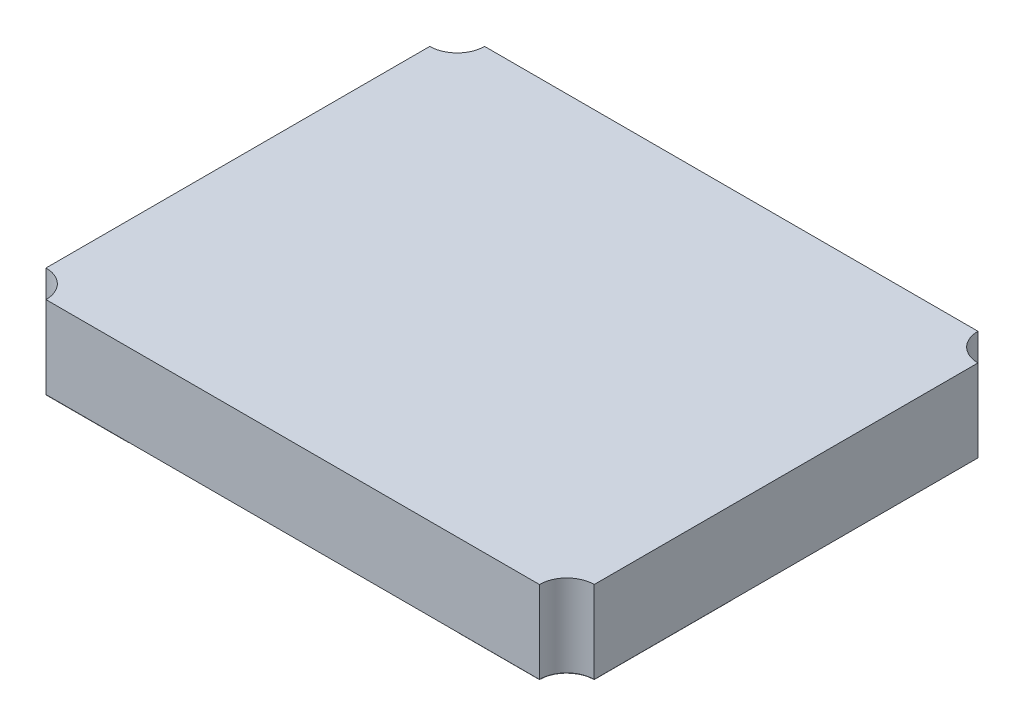
ISO-10303-21;
HEADER;
FILE_DESCRIPTION(('STEP AP214'),'2;1');
FILE_NAME('part.step','',(''),(''),'','','');
FILE_SCHEMA(('AUTOMOTIVE_DESIGN { 1 0 10303 214 1 1 1 1 }'));
ENDSEC;
DATA;
#1=APPLICATION_CONTEXT('core data for automotive mechanical design processes');
#2=APPLICATION_PROTOCOL_DEFINITION('international standard','automotive_design',2000,#1);
#3=PRODUCT_CONTEXT('',#1,'mechanical');
#4=PRODUCT('Part','Part','',(#3));
#5=PRODUCT_RELATED_PRODUCT_CATEGORY('part','',(#4));
#6=PRODUCT_DEFINITION_FORMATION('','',#4);
#7=PRODUCT_DEFINITION_CONTEXT('part definition',#1,'design');
#8=PRODUCT_DEFINITION('design','',#6,#7);
#9=PRODUCT_DEFINITION_SHAPE('','',#8);
#10=(LENGTH_UNIT() NAMED_UNIT(*) SI_UNIT(.MILLI.,.METRE.));
#11=(NAMED_UNIT(*) PLANE_ANGLE_UNIT() SI_UNIT($,.RADIAN.));
#12=(NAMED_UNIT(*) SI_UNIT($,.STERADIAN.) SOLID_ANGLE_UNIT());
#13=UNCERTAINTY_MEASURE_WITH_UNIT(LENGTH_MEASURE(1.E-05),#10,'distance_accuracy_value','');
#14=(GEOMETRIC_REPRESENTATION_CONTEXT(3) GLOBAL_UNCERTAINTY_ASSIGNED_CONTEXT((#13)) GLOBAL_UNIT_ASSIGNED_CONTEXT((#10,
#11,#12)) REPRESENTATION_CONTEXT('',''));
#15=CARTESIAN_POINT('',(0.,0.,0.));
#16=DIRECTION('',(0.,0.,1.));
#17=DIRECTION('',(1.,0.,0.));
#18=AXIS2_PLACEMENT_3D('',#15,#16,#17);
#19=CARTESIAN_POINT('',(0.799999993294,-0.001,0.499999997765));
#20=DIRECTION('',(0.,-1.,0.));
#21=DIRECTION('',(0.,0.,-1.));
#22=AXIS2_PLACEMENT_3D('',#19,#20,#21);
#23=PLANE('',#22);
#24=CARTESIAN_POINT('',(0.9,-0.001,0.8));
#25=DIRECTION('',(-1.,0.,0.));
#26=VECTOR('',#25,1.);
#27=LINE('',#24,#26);
#28=CARTESIAN_POINT('',(0.9,-0.0005,0.8));
#29=VERTEX_POINT('',#28);
#30=CARTESIAN_POINT('',(0.599999986589,-0.0005,0.8));
#31=VERTEX_POINT('',#30);
#32=EDGE_CURVE('P0_E46',#29,#31,#27,.T.);
#33=ORIENTED_EDGE('',*,*,#32,.T.);
#34=CARTESIAN_POINT('',(0.599999986589,-0.001,0.8));
#35=DIRECTION('',(0.,0.,-1.));
#36=VECTOR('',#35,1.);
#37=LINE('',#34,#36);
#38=CARTESIAN_POINT('',(0.599999986589,-0.0005,0.19999999553));
#39=VERTEX_POINT('',#38);
#40=EDGE_CURVE('P0_E43',#31,#39,#37,.T.);
#41=ORIENTED_EDGE('',*,*,#40,.T.);
#42=CARTESIAN_POINT('',(0.599999986589,-0.001,0.19999999553));
#43=DIRECTION('',(1.,0.,0.));
#44=VECTOR('',#43,1.);
#45=LINE('',#42,#44);
#46=CARTESIAN_POINT('',(0.999999977648,-0.0005,0.19999999553));
#47=VERTEX_POINT('',#46);
#48=EDGE_CURVE('P0_E104',#39,#47,#45,.T.);
#49=ORIENTED_EDGE('',*,*,#48,.T.);
#50=CARTESIAN_POINT('',(0.999999977648,-0.001,0.19999999553));
#51=DIRECTION('',(0.,0.,1.));
#52=VECTOR('',#51,1.);
#53=LINE('',#50,#52);
#54=CARTESIAN_POINT('',(0.999999982304557,-0.0005,0.7));
#55=VERTEX_POINT('',#54);
#56=EDGE_CURVE('P0_E27',#47,#55,#53,.T.);
#57=ORIENTED_EDGE('',*,*,#56,.T.);
#58=CARTESIAN_POINT('',(0.999999986961113,-0.001,0.7));
#59=CARTESIAN_POINT('',(0.959351857945959,-0.001,0.700000005300111));
#60=CARTESIAN_POINT('',(0.929289317271363,-0.001,0.729289326491328));
#61=CARTESIAN_POINT('',(0.9,-0.001,0.757825311866552));
#62=CARTESIAN_POINT('',(0.9,-0.001,0.8));
#63=B_SPLINE_CURVE_WITH_KNOTS('',2,(#58,#59,#60,#61,#62),.UNSPECIFIED.,.F.,.F.,(3,2,3),(0.,0.5,
1.),.UNSPECIFIED.);
#64=EDGE_CURVE('P0_E11',#55,#29,#63,.T.);
#65=ORIENTED_EDGE('',*,*,#64,.T.);
#66=EDGE_LOOP('',(#33,#41,#49,#57,#65));
#67=FACE_BOUND('',#66,.T.);
#68=ADVANCED_FACE('P0_F16',(#67),#23,.T.);
#69=CARTESIAN_POINT('',(0.799999993294,0.,0.499999997765));
#70=DIRECTION('',(0.,-1.,0.));
#71=DIRECTION('',(0.,0.,-1.));
#72=AXIS2_PLACEMENT_3D('',#69,#70,#71);
#73=PLANE('',#72);
#74=ORIENTED_EDGE('',*,*,#56,.F.);
#75=ORIENTED_EDGE('',*,*,#48,.F.);
#76=ORIENTED_EDGE('',*,*,#40,.F.);
#77=ORIENTED_EDGE('',*,*,#32,.F.);
#78=ORIENTED_EDGE('',*,*,#64,.F.);
#79=EDGE_LOOP('',(#74,#75,#76,#77,#78));
#80=FACE_BOUND('',#79,.T.);
#81=ADVANCED_FACE('P0_F48',(#80),#73,.F.);
#82=CLOSED_SHELL('',(#68,#81));
#83=MANIFOLD_SOLID_BREP('P0_B1',#82);
#84=CARTESIAN_POINT('',(0.,0.,0.));
#85=DIRECTION('',(0.,-1.,0.));
#86=DIRECTION('',(0.,0.,-1.));
#87=AXIS2_PLACEMENT_3D('',#84,#85,#86);
#88=PLANE('',#87);
#89=DIRECTION('',(0.,0.,1.));
#90=VECTOR('',#89,1.);
#91=CARTESIAN_POINT('',(-1.,0.,0.7));
#92=LINE('',#91,#90);
#93=CARTESIAN_POINT('',(-1.,0.,-0.7));
#94=VERTEX_POINT('',#93);
#95=CARTESIAN_POINT('',(-1.,0.,0.7));
#96=VERTEX_POINT('',#95);
#97=EDGE_CURVE('P1_E109',#94,#96,#92,.T.);
#98=ORIENTED_EDGE('',*,*,#97,.F.);
#99=CARTESIAN_POINT('',(-1.,0.,-0.8));
#100=DIRECTION('',(0.,-1.,0.));
#101=DIRECTION('',(0.,0.,-1.));
#102=AXIS2_PLACEMENT_3D('',#99,#100,#101);
#103=CIRCLE('',#102,0.1);
#104=CARTESIAN_POINT('',(-0.9,0.,-0.8));
#105=VERTEX_POINT('',#104);
#106=EDGE_CURVE('P1_E88',#94,#105,#103,.F.);
#107=ORIENTED_EDGE('',*,*,#106,.T.);
#108=DIRECTION('',(-1.,0.,0.));
#109=VECTOR('',#108,1.);
#110=CARTESIAN_POINT('',(-0.9,0.,-0.8));
#111=LINE('',#110,#109);
#112=CARTESIAN_POINT('',(0.9,0.,-0.8));
#113=VERTEX_POINT('',#112);
#114=EDGE_CURVE('P1_E86',#113,#105,#111,.T.);
#115=ORIENTED_EDGE('',*,*,#114,.F.);
#116=CARTESIAN_POINT('',(1.,0.,-0.8));
#117=DIRECTION('',(0.,-1.,0.));
#118=DIRECTION('',(0.,0.,-1.));
#119=AXIS2_PLACEMENT_3D('',#116,#117,#118);
#120=CIRCLE('',#119,0.1);
#121=CARTESIAN_POINT('',(1.,0.,-0.7));
#122=VERTEX_POINT('',#121);
#123=EDGE_CURVE('P1_E19',#113,#122,#120,.F.);
#124=ORIENTED_EDGE('',*,*,#123,.T.);
#125=DIRECTION('',(0.,0.,-1.));
#126=VECTOR('',#125,1.);
#127=CARTESIAN_POINT('',(1.,0.,0.));
#128=LINE('',#127,#126);
#129=CARTESIAN_POINT('',(1.,0.,0.7));
#130=VERTEX_POINT('',#129);
#131=EDGE_CURVE('P1_E84',#122,#130,#128,.F.);
#132=ORIENTED_EDGE('',*,*,#131,.T.);
#133=CARTESIAN_POINT('',(1.,0.,0.8));
#134=DIRECTION('',(0.,-1.,0.));
#135=DIRECTION('',(0.,0.,-1.));
#136=AXIS2_PLACEMENT_3D('',#133,#134,#135);
#137=CIRCLE('',#136,0.1);
#138=CARTESIAN_POINT('',(0.9,0.,0.8));
#139=VERTEX_POINT('',#138);
#140=EDGE_CURVE('P1_E118',#130,#139,#137,.F.);
#141=ORIENTED_EDGE('',*,*,#140,.T.);
#142=DIRECTION('',(1.,0.,0.));
#143=VECTOR('',#142,1.);
#144=CARTESIAN_POINT('',(0.9,0.,0.8));
#145=LINE('',#144,#143);
#146=CARTESIAN_POINT('',(-0.9,0.,0.8));
#147=VERTEX_POINT('',#146);
#148=EDGE_CURVE('P1_E115',#147,#139,#145,.T.);
#149=ORIENTED_EDGE('',*,*,#148,.F.);
#150=CARTESIAN_POINT('',(-1.,0.,0.8));
#151=DIRECTION('',(0.,-1.,0.));
#152=DIRECTION('',(0.,0.,-1.));
#153=AXIS2_PLACEMENT_3D('',#150,#151,#152);
#154=CIRCLE('',#153,0.1);
#155=EDGE_CURVE('P1_E113',#147,#96,#154,.F.);
#156=ORIENTED_EDGE('',*,*,#155,.T.);
#157=EDGE_LOOP('',(#98,#107,#115,#124,#132,#141,#149,#156));
#158=FACE_BOUND('',#157,.T.);
#159=ADVANCED_FACE('P1_F16',(#158),#88,.T.);
#160=CARTESIAN_POINT('',(1.,0.3,0.8));
#161=DIRECTION('',(0.,-1.,0.));
#162=DIRECTION('',(0.,0.,-1.));
#163=AXIS2_PLACEMENT_3D('',#160,#161,#162);
#164=CYLINDRICAL_SURFACE('',#163,0.1);
#165=DIRECTION('',(0.,1.,0.));
#166=VECTOR('',#165,1.);
#167=CARTESIAN_POINT('',(1.,0.3,0.7));
#168=LINE('',#167,#166);
#169=CARTESIAN_POINT('',(1.,0.3,0.7));
#170=VERTEX_POINT('',#169);
#171=EDGE_CURVE('P1_E97',#170,#130,#168,.F.);
#172=ORIENTED_EDGE('',*,*,#171,.F.);
#173=CARTESIAN_POINT('',(1.,0.3,0.8));
#174=DIRECTION('',(0.,-1.,0.));
#175=DIRECTION('',(0.,0.,-1.));
#176=AXIS2_PLACEMENT_3D('',#173,#174,#175);
#177=CIRCLE('',#176,0.1);
#178=CARTESIAN_POINT('',(0.9,0.3,0.8));
#179=VERTEX_POINT('',#178);
#180=EDGE_CURVE('P1_E130',#170,#179,#177,.F.);
#181=ORIENTED_EDGE('',*,*,#180,.T.);
#182=DIRECTION('',(0.,1.,0.));
#183=VECTOR('',#182,1.);
#184=CARTESIAN_POINT('',(0.9,0.3,0.8));
#185=LINE('',#184,#183);
#186=EDGE_CURVE('P1_E114',#139,#179,#185,.T.);
#187=ORIENTED_EDGE('',*,*,#186,.F.);
#188=ORIENTED_EDGE('',*,*,#140,.F.);
#189=EDGE_LOOP('',(#172,#181,#187,#188));
#190=FACE_BOUND('',#189,.T.);
#191=ADVANCED_FACE('P1_F141',(#190),#164,.F.);
#192=CARTESIAN_POINT('',(0.9,0.3,0.8));
#193=DIRECTION('',(0.,0.,1.));
#194=DIRECTION('',(1.,0.,0.));
#195=AXIS2_PLACEMENT_3D('',#192,#193,#194);
#196=PLANE('',#195);
#197=ORIENTED_EDGE('',*,*,#148,.T.);
#198=ORIENTED_EDGE('',*,*,#186,.T.);
#199=DIRECTION('',(1.,0.,0.));
#200=VECTOR('',#199,1.);
#201=CARTESIAN_POINT('',(0.,0.3,0.8));
#202=LINE('',#201,#200);
#203=CARTESIAN_POINT('',(-0.9,0.3,0.8));
#204=VERTEX_POINT('',#203);
#205=EDGE_CURVE('P1_E129',#179,#204,#202,.F.);
#206=ORIENTED_EDGE('',*,*,#205,.T.);
#207=DIRECTION('',(0.,-1.,0.));
#208=VECTOR('',#207,1.);
#209=CARTESIAN_POINT('',(-0.9,0.3,0.8));
#210=LINE('',#209,#208);
#211=EDGE_CURVE('P1_E110',#204,#147,#210,.T.);
#212=ORIENTED_EDGE('',*,*,#211,.T.);
#213=EDGE_LOOP('',(#197,#198,#206,#212));
#214=FACE_BOUND('',#213,.T.);
#215=ADVANCED_FACE('P1_F145',(#214),#196,.T.);
#216=CARTESIAN_POINT('',(-1.,0.3,0.8));
#217=DIRECTION('',(0.,-1.,0.));
#218=DIRECTION('',(0.,0.,-1.));
#219=AXIS2_PLACEMENT_3D('',#216,#217,#218);
#220=CYLINDRICAL_SURFACE('',#219,0.1);
#221=ORIENTED_EDGE('',*,*,#211,.F.);
#222=CARTESIAN_POINT('',(-1.,0.3,0.8));
#223=DIRECTION('',(0.,-1.,0.));
#224=DIRECTION('',(0.,0.,-1.));
#225=AXIS2_PLACEMENT_3D('',#222,#223,#224);
#226=CIRCLE('',#225,0.1);
#227=CARTESIAN_POINT('',(-1.,0.3,0.7));
#228=VERTEX_POINT('',#227);
#229=EDGE_CURVE('P1_E126',#204,#228,#226,.F.);
#230=ORIENTED_EDGE('',*,*,#229,.T.);
#231=DIRECTION('',(0.,1.,0.));
#232=VECTOR('',#231,1.);
#233=CARTESIAN_POINT('',(-1.,0.3,0.7));
#234=LINE('',#233,#232);
#235=EDGE_CURVE('P1_E107',#96,#228,#234,.T.);
#236=ORIENTED_EDGE('',*,*,#235,.F.);
#237=ORIENTED_EDGE('',*,*,#155,.F.);
#238=EDGE_LOOP('',(#221,#230,#236,#237));
#239=FACE_BOUND('',#238,.T.);
#240=ADVANCED_FACE('P1_F159',(#239),#220,.F.);
#241=CARTESIAN_POINT('',(-1.,0.3,0.7));
#242=DIRECTION('',(-1.,0.,0.));
#243=DIRECTION('',(0.,0.,1.));
#244=AXIS2_PLACEMENT_3D('',#241,#242,#243);
#245=PLANE('',#244);
#246=ORIENTED_EDGE('',*,*,#97,.T.);
#247=ORIENTED_EDGE('',*,*,#235,.T.);
#248=DIRECTION('',(0.,0.,-1.));
#249=VECTOR('',#248,1.);
#250=CARTESIAN_POINT('',(-1.,0.3,0.));
#251=LINE('',#250,#249);
#252=CARTESIAN_POINT('',(-1.,0.3,-0.7));
#253=VERTEX_POINT('',#252);
#254=EDGE_CURVE('P1_E125',#228,#253,#251,.T.);
#255=ORIENTED_EDGE('',*,*,#254,.T.);
#256=DIRECTION('',(0.,-1.,0.));
#257=VECTOR('',#256,1.);
#258=CARTESIAN_POINT('',(-1.,0.3,-0.7));
#259=LINE('',#258,#257);
#260=EDGE_CURVE('P1_E104',#253,#94,#259,.T.);
#261=ORIENTED_EDGE('',*,*,#260,.T.);
#262=EDGE_LOOP('',(#246,#247,#255,#261));
#263=FACE_BOUND('',#262,.T.);
#264=ADVANCED_FACE('P1_F155',(#263),#245,.T.);
#265=CARTESIAN_POINT('',(-1.,0.3,-0.8));
#266=DIRECTION('',(0.,-1.,0.));
#267=DIRECTION('',(0.,0.,-1.));
#268=AXIS2_PLACEMENT_3D('',#265,#266,#267);
#269=CYLINDRICAL_SURFACE('',#268,0.1);
#270=ORIENTED_EDGE('',*,*,#260,.F.);
#271=CARTESIAN_POINT('',(-1.,0.3,-0.8));
#272=DIRECTION('',(0.,-1.,0.));
#273=DIRECTION('',(0.,0.,-1.));
#274=AXIS2_PLACEMENT_3D('',#271,#272,#273);
#275=CIRCLE('',#274,0.1);
#276=CARTESIAN_POINT('',(-0.9,0.3,-0.8));
#277=VERTEX_POINT('',#276);
#278=EDGE_CURVE('P1_E122',#253,#277,#275,.F.);
#279=ORIENTED_EDGE('',*,*,#278,.T.);
#280=DIRECTION('',(0.,1.,0.));
#281=VECTOR('',#280,1.);
#282=CARTESIAN_POINT('',(-0.9,0.3,-0.8));
#283=LINE('',#282,#281);
#284=EDGE_CURVE('P1_E91',#105,#277,#283,.T.);
#285=ORIENTED_EDGE('',*,*,#284,.F.);
#286=ORIENTED_EDGE('',*,*,#106,.F.);
#287=EDGE_LOOP('',(#270,#279,#285,#286));
#288=FACE_BOUND('',#287,.T.);
#289=ADVANCED_FACE('P1_F161',(#288),#269,.F.);
#290=CARTESIAN_POINT('',(-0.9,0.3,-0.8));
#291=DIRECTION('',(0.,0.,-1.));
#292=DIRECTION('',(-1.,0.,0.));
#293=AXIS2_PLACEMENT_3D('',#290,#291,#292);
#294=PLANE('',#293);
#295=ORIENTED_EDGE('',*,*,#114,.T.);
#296=ORIENTED_EDGE('',*,*,#284,.T.);
#297=DIRECTION('',(1.,0.,0.));
#298=VECTOR('',#297,1.);
#299=CARTESIAN_POINT('',(0.,0.3,-0.8));
#300=LINE('',#299,#298);
#301=CARTESIAN_POINT('',(0.9,0.3,-0.8));
#302=VERTEX_POINT('',#301);
#303=EDGE_CURVE('P1_E96',#277,#302,#300,.T.);
#304=ORIENTED_EDGE('',*,*,#303,.T.);
#305=DIRECTION('',(0.,-1.,0.));
#306=VECTOR('',#305,1.);
#307=CARTESIAN_POINT('',(0.9,0.3,-0.8));
#308=LINE('',#307,#306);
#309=EDGE_CURVE('P1_E81',#302,#113,#308,.T.);
#310=ORIENTED_EDGE('',*,*,#309,.T.);
#311=EDGE_LOOP('',(#295,#296,#304,#310));
#312=FACE_BOUND('',#311,.T.);
#313=ADVANCED_FACE('P1_F94',(#312),#294,.T.);
#314=CARTESIAN_POINT('',(1.,0.3,-0.8));
#315=DIRECTION('',(0.,-1.,0.));
#316=DIRECTION('',(0.,0.,-1.));
#317=AXIS2_PLACEMENT_3D('',#314,#315,#316);
#318=CYLINDRICAL_SURFACE('',#317,0.1);
#319=ORIENTED_EDGE('',*,*,#309,.F.);
#320=CARTESIAN_POINT('',(1.,0.3,-0.8));
#321=DIRECTION('',(0.,-1.,0.));
#322=DIRECTION('',(0.,0.,-1.));
#323=AXIS2_PLACEMENT_3D('',#320,#321,#322);
#324=CIRCLE('',#323,0.1);
#325=CARTESIAN_POINT('',(1.,0.3,-0.7));
#326=VERTEX_POINT('',#325);
#327=EDGE_CURVE('P1_E25',#302,#326,#324,.F.);
#328=ORIENTED_EDGE('',*,*,#327,.T.);
#329=DIRECTION('',(0.,1.,0.));
#330=VECTOR('',#329,1.);
#331=CARTESIAN_POINT('',(1.,0.3,-0.7));
#332=LINE('',#331,#330);
#333=EDGE_CURVE('P1_E33',#122,#326,#332,.T.);
#334=ORIENTED_EDGE('',*,*,#333,.F.);
#335=ORIENTED_EDGE('',*,*,#123,.F.);
#336=EDGE_LOOP('',(#319,#328,#334,#335));
#337=FACE_BOUND('',#336,.T.);
#338=ADVANCED_FACE('P1_F78',(#337),#318,.F.);
#339=CARTESIAN_POINT('',(1.,0.3,-0.7));
#340=DIRECTION('',(1.,0.,0.));
#341=DIRECTION('',(0.,0.,-1.));
#342=AXIS2_PLACEMENT_3D('',#339,#340,#341);
#343=PLANE('',#342);
#344=ORIENTED_EDGE('',*,*,#131,.F.);
#345=ORIENTED_EDGE('',*,*,#333,.T.);
#346=DIRECTION('',(0.,0.,-1.));
#347=VECTOR('',#346,1.);
#348=CARTESIAN_POINT('',(1.,0.3,0.));
#349=LINE('',#348,#347);
#350=EDGE_CURVE('P1_E11',#326,#170,#349,.F.);
#351=ORIENTED_EDGE('',*,*,#350,.T.);
#352=ORIENTED_EDGE('',*,*,#171,.T.);
#353=EDGE_LOOP('',(#344,#345,#351,#352));
#354=FACE_BOUND('',#353,.T.);
#355=ADVANCED_FACE('P1_F162',(#354),#343,.T.);
#356=CARTESIAN_POINT('',(0.,0.3,0.));
#357=DIRECTION('',(0.,-1.,0.));
#358=DIRECTION('',(0.,0.,-1.));
#359=AXIS2_PLACEMENT_3D('',#356,#357,#358);
#360=PLANE('',#359);
#361=ORIENTED_EDGE('',*,*,#327,.F.);
#362=ORIENTED_EDGE('',*,*,#303,.F.);
#363=ORIENTED_EDGE('',*,*,#278,.F.);
#364=ORIENTED_EDGE('',*,*,#254,.F.);
#365=ORIENTED_EDGE('',*,*,#229,.F.);
#366=ORIENTED_EDGE('',*,*,#205,.F.);
#367=ORIENTED_EDGE('',*,*,#180,.F.);
#368=ORIENTED_EDGE('',*,*,#350,.F.);
#369=EDGE_LOOP('',(#361,#362,#363,#364,#365,#366,#367,#368));
#370=FACE_BOUND('',#369,.T.);
#371=ADVANCED_FACE('P1_F148',(#370),#360,.F.);
#372=CLOSED_SHELL('',(#159,#191,#215,#240,#264,#289,#313,#338,#355,#371));
#373=MANIFOLD_SOLID_BREP('P1_B1',#372);
#374=CARTESIAN_POINT('',(-0.799999993294,-0.001,-0.5));
#375=DIRECTION('',(0.,-1.,0.));
#376=DIRECTION('',(0.,0.,-1.));
#377=AXIS2_PLACEMENT_3D('',#374,#375,#376);
#378=PLANE('',#377);
#379=CARTESIAN_POINT('',(-1.,-0.001,-0.7));
#380=CARTESIAN_POINT('',(-0.959351867215471,-0.001,-0.7));
#381=CARTESIAN_POINT('',(-0.929289321881345,-0.001,-0.729289321881346));
#382=CARTESIAN_POINT('',(-0.9,-0.001,-0.75782530799744));
#383=CARTESIAN_POINT('',(-0.9,-0.001,-0.8));
#384=B_SPLINE_CURVE_WITH_KNOTS('',2,(#379,#380,#381,#382,#383),.UNSPECIFIED.,.F.,.F.,(3,2,3),
(0.,0.5,1.),.UNSPECIFIED.);
#385=CARTESIAN_POINT('',(-1.,-0.001,-0.7));
#386=VERTEX_POINT('',#385);
#387=CARTESIAN_POINT('',(-0.9,-0.001,-0.8));
#388=VERTEX_POINT('',#387);
#389=EDGE_CURVE('P2_E23',#386,#388,#384,.T.);
#390=ORIENTED_EDGE('',*,*,#389,.T.);
#391=DIRECTION('',(1.,0.,0.));
#392=VECTOR('',#391,1.);
#393=CARTESIAN_POINT('',(-0.799999993294,-0.001,-0.8));
#394=LINE('',#393,#392);
#395=CARTESIAN_POINT('',(-0.599999986589,-0.001,-0.8));
#396=VERTEX_POINT('',#395);
#397=EDGE_CURVE('P2_E11',#388,#396,#394,.T.);
#398=ORIENTED_EDGE('',*,*,#397,.T.);
#399=DIRECTION('',(0.,0.,-1.));
#400=VECTOR('',#399,1.);
#401=CARTESIAN_POINT('',(-0.599999986589,-0.001,-0.5));
#402=LINE('',#401,#400);
#403=CARTESIAN_POINT('',(-0.599999986589,-0.001,-0.2));
#404=VERTEX_POINT('',#403);
#405=EDGE_CURVE('P2_E18',#396,#404,#402,.F.);
#406=ORIENTED_EDGE('',*,*,#405,.T.);
#407=DIRECTION('',(1.,0.,0.));
#408=VECTOR('',#407,1.);
#409=CARTESIAN_POINT('',(-0.799999993294,-0.001,-0.2));
#410=LINE('',#409,#408);
#411=CARTESIAN_POINT('',(-1.,-0.001,-0.2));
#412=VERTEX_POINT('',#411);
#413=EDGE_CURVE('P2_E44',#404,#412,#410,.F.);
#414=ORIENTED_EDGE('',*,*,#413,.T.);
#415=DIRECTION('',(0.,0.,-1.));
#416=VECTOR('',#415,1.);
#417=CARTESIAN_POINT('',(-1.,-0.001,-0.5));
#418=LINE('',#417,#416);
#419=EDGE_CURVE('P2_E34',#412,#386,#418,.T.);
#420=ORIENTED_EDGE('',*,*,#419,.T.);
#421=EDGE_LOOP('',(#390,#398,#406,#414,#420));
#422=FACE_BOUND('',#421,.T.);
#423=ADVANCED_FACE('P2_F16',(#422),#378,.T.);
#424=OPEN_SHELL('',(#423));
#425=SHELL_BASED_SURFACE_MODEL('P2_B1',(#424));
#426=CARTESIAN_POINT('',(0.799999993294,0.,-0.499999997765));
#427=DIRECTION('',(0.,-1.,0.));
#428=DIRECTION('',(0.,0.,-1.));
#429=AXIS2_PLACEMENT_3D('',#426,#427,#428);
#430=PLANE('',#429);
#431=DIRECTION('',(0.,0.,-1.));
#432=VECTOR('',#431,1.);
#433=CARTESIAN_POINT('',(0.599999986589,0.,-0.499999997765));
#434=LINE('',#433,#432);
#435=CARTESIAN_POINT('',(0.599999986589,0.,-0.19999999553));
#436=VERTEX_POINT('',#435);
#437=CARTESIAN_POINT('',(0.599999986589,0.,-0.8));
#438=VERTEX_POINT('',#437);
#439=EDGE_CURVE('P3_E24',#436,#438,#434,.T.);
#440=ORIENTED_EDGE('',*,*,#439,.T.);
#441=DIRECTION('',(1.,0.,0.));
#442=VECTOR('',#441,1.);
#443=CARTESIAN_POINT('',(0.799999993294,0.,-0.8));
#444=LINE('',#443,#442);
#445=CARTESIAN_POINT('',(0.9,0.,-0.8));
#446=VERTEX_POINT('',#445);
#447=EDGE_CURVE('P3_E11',#438,#446,#444,.T.);
#448=ORIENTED_EDGE('',*,*,#447,.T.);
#449=CARTESIAN_POINT('',(0.9,0.,-0.8));
#450=CARTESIAN_POINT('',(0.9,0.,-0.75935186721547));
#451=CARTESIAN_POINT('',(0.929289321881345,0.,-0.729289321881346));
#452=CARTESIAN_POINT('',(0.95782530799744,0.,-0.7));
#453=CARTESIAN_POINT('',(1.,0.,-0.7));
#454=B_SPLINE_CURVE_WITH_KNOTS('',2,(#449,#450,#451,#452,#453),.UNSPECIFIED.,.F.,.F.,(3,2,3),
(0.,0.5,1.),.UNSPECIFIED.);
#455=CARTESIAN_POINT('',(1.,0.,-0.7));
#456=VERTEX_POINT('',#455);
#457=EDGE_CURVE('P3_E40',#446,#456,#454,.T.);
#458=ORIENTED_EDGE('',*,*,#457,.T.);
#459=DIRECTION('',(0.,0.,-1.));
#460=VECTOR('',#459,1.);
#461=CARTESIAN_POINT('',(1.,0.,-0.499999997765));
#462=LINE('',#461,#460);
#463=CARTESIAN_POINT('',(1.,0.,-0.19999999553));
#464=VERTEX_POINT('',#463);
#465=EDGE_CURVE('P3_E18',#456,#464,#462,.F.);
#466=ORIENTED_EDGE('',*,*,#465,.T.);
#467=DIRECTION('',(1.,0.,0.));
#468=VECTOR('',#467,1.);
#469=CARTESIAN_POINT('',(0.799999993294,0.,-0.19999999553));
#470=LINE('',#469,#468);
#471=EDGE_CURVE('P3_E46',#464,#436,#470,.F.);
#472=ORIENTED_EDGE('',*,*,#471,.T.);
#473=EDGE_LOOP('',(#440,#448,#458,#466,#472));
#474=FACE_BOUND('',#473,.T.);
#475=ADVANCED_FACE('P3_F16',(#474),#430,.T.);
#476=OPEN_SHELL('',(#475));
#477=SHELL_BASED_SURFACE_MODEL('P3_B1',(#476));
#478=CARTESIAN_POINT('',(0.799999993294,0.,-0.499999997765));
#479=DIRECTION('',(0.,-1.,0.));
#480=DIRECTION('',(0.,0.,-1.));
#481=AXIS2_PLACEMENT_3D('',#478,#479,#480);
#482=PLANE('',#481);
#483=DIRECTION('',(1.,0.,0.));
#484=VECTOR('',#483,1.);
#485=CARTESIAN_POINT('',(0.799999993294,0.,-0.8));
#486=LINE('',#485,#484);
#487=CARTESIAN_POINT('',(0.599999986589,0.,-0.8));
#488=VERTEX_POINT('',#487);
#489=CARTESIAN_POINT('',(0.9,0.,-0.8));
#490=VERTEX_POINT('',#489);
#491=EDGE_CURVE('P4_E24',#488,#490,#486,.T.);
#492=ORIENTED_EDGE('',*,*,#491,.T.);
#493=CARTESIAN_POINT('',(0.9,0.,-0.8));
#494=CARTESIAN_POINT('',(0.9,0.,-0.75935186721547));
#495=CARTESIAN_POINT('',(0.929289321881345,0.,-0.729289321881346));
#496=CARTESIAN_POINT('',(0.95782530799744,0.,-0.7));
#497=CARTESIAN_POINT('',(1.,0.,-0.7));
#498=B_SPLINE_CURVE_WITH_KNOTS('',2,(#493,#494,#495,#496,#497),.UNSPECIFIED.,.F.,.F.,(3,2,3),
(0.,0.5,1.),.UNSPECIFIED.);
#499=CARTESIAN_POINT('',(1.,0.,-0.7));
#500=VERTEX_POINT('',#499);
#501=EDGE_CURVE('P4_E11',#490,#500,#498,.T.);
#502=ORIENTED_EDGE('',*,*,#501,.T.);
#503=DIRECTION('',(0.,0.,-1.));
#504=VECTOR('',#503,1.);
#505=CARTESIAN_POINT('',(1.,0.,-0.499999997765));
#506=LINE('',#505,#504);
#507=CARTESIAN_POINT('',(1.,0.,-0.19999999553));
#508=VERTEX_POINT('',#507);
#509=EDGE_CURVE('P4_E18',#500,#508,#506,.F.);
#510=ORIENTED_EDGE('',*,*,#509,.T.);
#511=DIRECTION('',(1.,0.,0.));
#512=VECTOR('',#511,1.);
#513=CARTESIAN_POINT('',(0.799999993294,0.,-0.19999999553));
#514=LINE('',#513,#512);
#515=CARTESIAN_POINT('',(0.599999986589,0.,-0.19999999553));
#516=VERTEX_POINT('',#515);
#517=EDGE_CURVE('P4_E40',#508,#516,#514,.F.);
#518=ORIENTED_EDGE('',*,*,#517,.T.);
#519=DIRECTION('',(0.,0.,-1.));
#520=VECTOR('',#519,1.);
#521=CARTESIAN_POINT('',(0.599999986589,0.,-0.499999997765));
#522=LINE('',#521,#520);
#523=EDGE_CURVE('P4_E42',#516,#488,#522,.T.);
#524=ORIENTED_EDGE('',*,*,#523,.T.);
#525=EDGE_LOOP('',(#492,#502,#510,#518,#524));
#526=FACE_BOUND('',#525,.T.);
#527=ADVANCED_FACE('P4_F16',(#526),#482,.T.);
#528=OPEN_SHELL('',(#527));
#529=SHELL_BASED_SURFACE_MODEL('P4_B1',(#528));
#530=CARTESIAN_POINT('',(-0.799999993294,-0.001,0.499999997765));
#531=DIRECTION('',(0.,-1.,0.));
#532=DIRECTION('',(0.,0.,-1.));
#533=AXIS2_PLACEMENT_3D('',#530,#531,#532);
#534=PLANE('',#533);
#535=CARTESIAN_POINT('',(-0.9,-0.001,0.8));
#536=CARTESIAN_POINT('',(-0.9,-0.001,0.759351867215465));
#537=CARTESIAN_POINT('',(-0.929289321881345,-0.001,0.729289321881346));
#538=CARTESIAN_POINT('',(-0.957825307997445,-0.001,0.7));
#539=CARTESIAN_POINT('',(-1.,-0.001,0.7));
#540=B_SPLINE_CURVE_WITH_KNOTS('',2,(#535,#536,#537,#538,#539),.UNSPECIFIED.,.F.,.F.,(3,2,3),
(0.,0.5,1.),.UNSPECIFIED.);
#541=CARTESIAN_POINT('',(-0.9,-0.001,0.8));
#542=VERTEX_POINT('',#541);
#543=CARTESIAN_POINT('',(-1.,-0.001,0.7));
#544=VERTEX_POINT('',#543);
#545=EDGE_CURVE('P5_E23',#542,#544,#540,.T.);
#546=ORIENTED_EDGE('',*,*,#545,.T.);
#547=DIRECTION('',(0.,0.,-1.));
#548=VECTOR('',#547,1.);
#549=CARTESIAN_POINT('',(-1.,-0.001,0.499999997765));
#550=LINE('',#549,#548);
#551=CARTESIAN_POINT('',(-1.,-0.001,0.19999999553));
#552=VERTEX_POINT('',#551);
#553=EDGE_CURVE('P5_E11',#544,#552,#550,.T.);
#554=ORIENTED_EDGE('',*,*,#553,.T.);
#555=DIRECTION('',(1.,0.,0.));
#556=VECTOR('',#555,1.);
#557=CARTESIAN_POINT('',(-0.799999993294,-0.001,0.19999999553));
#558=LINE('',#557,#556);
#559=CARTESIAN_POINT('',(-0.599999986589,-0.001,0.19999999553));
#560=VERTEX_POINT('',#559);
#561=EDGE_CURVE('P5_E18',#552,#560,#558,.T.);
#562=ORIENTED_EDGE('',*,*,#561,.T.);
#563=DIRECTION('',(0.,0.,-1.));
#564=VECTOR('',#563,1.);
#565=CARTESIAN_POINT('',(-0.599999986589,-0.001,0.499999997765));
#566=LINE('',#565,#564);
#567=CARTESIAN_POINT('',(-0.599999986589,-0.001,0.8));
#568=VERTEX_POINT('',#567);
#569=EDGE_CURVE('P5_E44',#560,#568,#566,.F.);
#570=ORIENTED_EDGE('',*,*,#569,.T.);
#571=DIRECTION('',(1.,0.,0.));
#572=VECTOR('',#571,1.);
#573=CARTESIAN_POINT('',(-0.799999993294,-0.001,0.8));
#574=LINE('',#573,#572);
#575=EDGE_CURVE('P5_E34',#568,#542,#574,.F.);
#576=ORIENTED_EDGE('',*,*,#575,.T.);
#577=EDGE_LOOP('',(#546,#554,#562,#570,#576));
#578=FACE_BOUND('',#577,.T.);
#579=ADVANCED_FACE('P5_F16',(#578),#534,.T.);
#580=OPEN_SHELL('',(#579));
#581=SHELL_BASED_SURFACE_MODEL('P5_B1',(#580));
#582=ADVANCED_BREP_SHAPE_REPRESENTATION('',(#18,#83,#373),#14);
#583=MANIFOLD_SURFACE_SHAPE_REPRESENTATION('',(#18,#425,#477,#529,#581),#14);
#584=SHAPE_REPRESENTATION('',(#18),#14);
#585=SHAPE_DEFINITION_REPRESENTATION(#9,#584);
#586=SHAPE_REPRESENTATION_RELATIONSHIP('','',#584,#582);
#587=SHAPE_REPRESENTATION_RELATIONSHIP('','',#584,#583);
ENDSEC;
END-ISO-10303-21;
